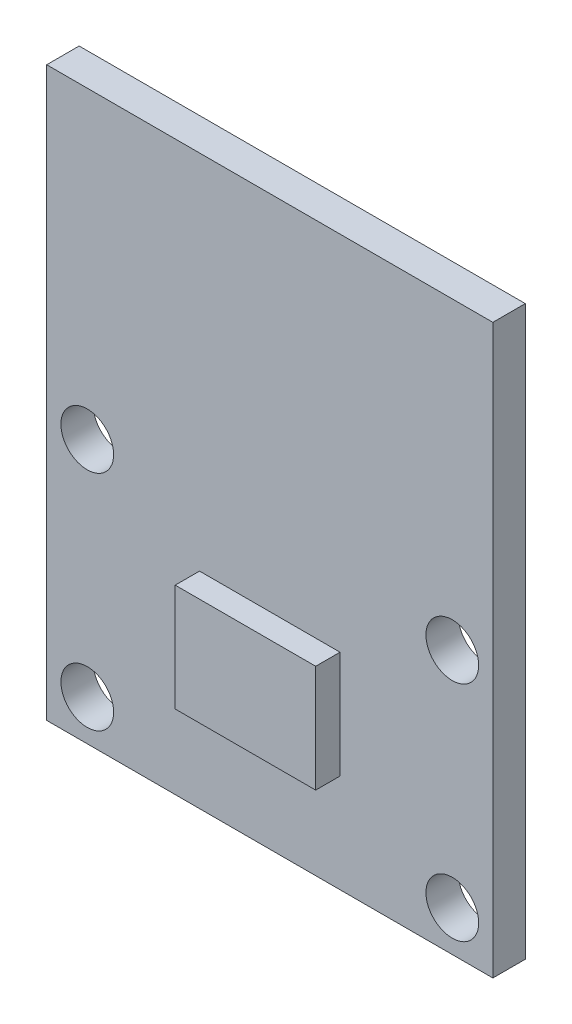
ISO-10303-21;
HEADER;
FILE_DESCRIPTION(('STEP AP214'),'2;1');
FILE_NAME('part.step','',(''),(''),'','','');
FILE_SCHEMA(('AUTOMOTIVE_DESIGN { 1 0 10303 214 1 1 1 1 }'));
ENDSEC;
DATA;
#1=APPLICATION_CONTEXT('core data for automotive mechanical design processes');
#2=APPLICATION_PROTOCOL_DEFINITION('international standard','automotive_design',2000,#1);
#3=PRODUCT_CONTEXT('',#1,'mechanical');
#4=PRODUCT('Part','Part','',(#3));
#5=PRODUCT_RELATED_PRODUCT_CATEGORY('part','',(#4));
#6=PRODUCT_DEFINITION_FORMATION('','',#4);
#7=PRODUCT_DEFINITION_CONTEXT('part definition',#1,'design');
#8=PRODUCT_DEFINITION('design','',#6,#7);
#9=PRODUCT_DEFINITION_SHAPE('','',#8);
#10=(LENGTH_UNIT() NAMED_UNIT(*) SI_UNIT(.MILLI.,.METRE.));
#11=(NAMED_UNIT(*) PLANE_ANGLE_UNIT() SI_UNIT($,.RADIAN.));
#12=(NAMED_UNIT(*) SI_UNIT($,.STERADIAN.) SOLID_ANGLE_UNIT());
#13=UNCERTAINTY_MEASURE_WITH_UNIT(LENGTH_MEASURE(1.E-05),#10,'distance_accuracy_value','');
#14=(GEOMETRIC_REPRESENTATION_CONTEXT(3) GLOBAL_UNCERTAINTY_ASSIGNED_CONTEXT((#13)) GLOBAL_UNIT_ASSIGNED_CONTEXT((#10,
#11,#12)) REPRESENTATION_CONTEXT('',''));
#15=CARTESIAN_POINT('',(0.,0.,0.));
#16=DIRECTION('',(0.,0.,1.));
#17=DIRECTION('',(1.,0.,0.));
#18=AXIS2_PLACEMENT_3D('',#15,#16,#17);
#19=CARTESIAN_POINT('',(0.,0.,1.6));
#20=DIRECTION('',(0.,0.,1.));
#21=DIRECTION('',(1.,0.,0.));
#22=AXIS2_PLACEMENT_3D('',#19,#20,#21);
#23=PLANE('',#22);
#24=CARTESIAN_POINT('',(-9.,-1.,1.6));
#25=DIRECTION('',(0.,0.,1.));
#26=DIRECTION('',(1.,0.,0.));
#27=AXIS2_PLACEMENT_3D('',#24,#25,#26);
#28=CIRCLE('',#27,1.3);
#29=CARTESIAN_POINT('',(-7.7,-1.,1.6));
#30=VERTEX_POINT('',#29);
#31=EDGE_CURVE('E144',#30,#30,#28,.T.);
#32=ORIENTED_EDGE('',*,*,#31,.F.);
#33=EDGE_LOOP('',(#32));
#34=FACE_BOUND('',#33,.T.);
#35=CARTESIAN_POINT('',(-9.,-12.,1.6));
#36=DIRECTION('',(0.,0.,1.));
#37=DIRECTION('',(1.,0.,0.));
#38=AXIS2_PLACEMENT_3D('',#35,#36,#37);
#39=CIRCLE('',#38,1.3);
#40=CARTESIAN_POINT('',(-7.7,-12.,1.6));
#41=VERTEX_POINT('',#40);
#42=EDGE_CURVE('E156',#41,#41,#39,.T.);
#43=ORIENTED_EDGE('',*,*,#42,.F.);
#44=EDGE_LOOP('',(#43));
#45=FACE_BOUND('',#44,.T.);
#46=DIRECTION('',(0.,1.,0.));
#47=VECTOR('',#46,1.);
#48=CARTESIAN_POINT('',(11.,14.,1.6));
#49=LINE('',#48,#47);
#50=CARTESIAN_POINT('',(11.,-14.,1.6));
#51=VERTEX_POINT('',#50);
#52=CARTESIAN_POINT('',(11.,14.,1.6));
#53=VERTEX_POINT('',#52);
#54=EDGE_CURVE('E162',#51,#53,#49,.T.);
#55=ORIENTED_EDGE('',*,*,#54,.T.);
#56=DIRECTION('',(-1.,0.,0.));
#57=VECTOR('',#56,1.);
#58=CARTESIAN_POINT('',(-11.,14.,1.6));
#59=LINE('',#58,#57);
#60=CARTESIAN_POINT('',(-11.,14.,1.6));
#61=VERTEX_POINT('',#60);
#62=EDGE_CURVE('E86',#53,#61,#59,.T.);
#63=ORIENTED_EDGE('',*,*,#62,.T.);
#64=DIRECTION('',(0.,-1.,0.));
#65=VECTOR('',#64,1.);
#66=CARTESIAN_POINT('',(-11.,14.,1.6));
#67=LINE('',#66,#65);
#68=CARTESIAN_POINT('',(-11.,-14.,1.6));
#69=VERTEX_POINT('',#68);
#70=EDGE_CURVE('E165',#61,#69,#67,.T.);
#71=ORIENTED_EDGE('',*,*,#70,.T.);
#72=DIRECTION('',(1.,0.,0.));
#73=VECTOR('',#72,1.);
#74=CARTESIAN_POINT('',(-11.,-14.,1.6));
#75=LINE('',#74,#73);
#76=EDGE_CURVE('E58',#69,#51,#75,.T.);
#77=ORIENTED_EDGE('',*,*,#76,.T.);
#78=EDGE_LOOP('',(#55,#63,#71,#77));
#79=FACE_BOUND('',#78,.T.);
#80=CARTESIAN_POINT('',(9.,-12.,1.6));
#81=DIRECTION('',(0.,0.,1.));
#82=DIRECTION('',(1.,0.,0.));
#83=AXIS2_PLACEMENT_3D('',#80,#81,#82);
#84=CIRCLE('',#83,1.3);
#85=CARTESIAN_POINT('',(10.3,-12.,1.6));
#86=VERTEX_POINT('',#85);
#87=EDGE_CURVE('E150',#86,#86,#84,.T.);
#88=ORIENTED_EDGE('',*,*,#87,.F.);
#89=EDGE_LOOP('',(#88));
#90=FACE_BOUND('',#89,.T.);
#91=CARTESIAN_POINT('',(9.,-1.,1.6));
#92=DIRECTION('',(0.,0.,1.));
#93=DIRECTION('',(1.,0.,0.));
#94=AXIS2_PLACEMENT_3D('',#91,#92,#93);
#95=CIRCLE('',#94,1.3);
#96=CARTESIAN_POINT('',(10.3,-1.,1.6));
#97=VERTEX_POINT('',#96);
#98=EDGE_CURVE('E136',#97,#97,#95,.T.);
#99=ORIENTED_EDGE('',*,*,#98,.F.);
#100=EDGE_LOOP('',(#99));
#101=FACE_BOUND('',#100,.T.);
#102=DIRECTION('',(-1.,0.,0.));
#103=VECTOR('',#102,1.);
#104=CARTESIAN_POINT('',(-3.46343343206932,-3.85520353665282,1.6));
#105=LINE('',#104,#103);
#106=CARTESIAN_POINT('',(3.46343343206932,-3.85520353665282,1.6));
#107=VERTEX_POINT('',#106);
#108=CARTESIAN_POINT('',(-3.46343343206932,-3.85520353665282,1.6));
#109=VERTEX_POINT('',#108);
#110=EDGE_CURVE('E332',#107,#109,#105,.T.);
#111=ORIENTED_EDGE('',*,*,#110,.F.);
#112=DIRECTION('',(0.,1.,0.));
#113=VECTOR('',#112,1.);
#114=CARTESIAN_POINT('',(3.46343343206932,-3.85520353665282,1.6));
#115=LINE('',#114,#113);
#116=CARTESIAN_POINT('',(3.46343343206932,-9.14479646334718,1.6));
#117=VERTEX_POINT('',#116);
#118=EDGE_CURVE('E131',#117,#107,#115,.T.);
#119=ORIENTED_EDGE('',*,*,#118,.F.);
#120=DIRECTION('',(1.,0.,0.));
#121=VECTOR('',#120,1.);
#122=CARTESIAN_POINT('',(-3.46343343206932,-9.14479646334718,1.6));
#123=LINE('',#122,#121);
#124=CARTESIAN_POINT('',(-3.46343343206932,-9.14479646334718,1.6));
#125=VERTEX_POINT('',#124);
#126=EDGE_CURVE('E127',#125,#117,#123,.T.);
#127=ORIENTED_EDGE('',*,*,#126,.F.);
#128=DIRECTION('',(0.,-1.,0.));
#129=VECTOR('',#128,1.);
#130=CARTESIAN_POINT('',(-3.46343343206932,-3.85520353665282,1.6));
#131=LINE('',#130,#129);
#132=EDGE_CURVE('E329',#109,#125,#131,.T.);
#133=ORIENTED_EDGE('',*,*,#132,.F.);
#134=EDGE_LOOP('',(#111,#119,#127,#133));
#135=FACE_BOUND('',#134,.T.);
#136=ADVANCED_FACE('F34',(#34,#45,#79,#90,#101,#135),#23,.T.);
#137=CARTESIAN_POINT('',(0.,0.,0.));
#138=DIRECTION('',(0.,0.,1.));
#139=DIRECTION('',(1.,0.,0.));
#140=AXIS2_PLACEMENT_3D('',#137,#138,#139);
#141=PLANE('',#140);
#142=DIRECTION('',(0.,1.,0.));
#143=VECTOR('',#142,1.);
#144=CARTESIAN_POINT('',(11.,14.,0.));
#145=LINE('',#144,#143);
#146=CARTESIAN_POINT('',(11.,-14.,0.));
#147=VERTEX_POINT('',#146);
#148=CARTESIAN_POINT('',(11.,14.,0.));
#149=VERTEX_POINT('',#148);
#150=EDGE_CURVE('E159',#147,#149,#145,.T.);
#151=ORIENTED_EDGE('',*,*,#150,.F.);
#152=DIRECTION('',(1.,0.,0.));
#153=VECTOR('',#152,1.);
#154=CARTESIAN_POINT('',(-11.,-14.,0.));
#155=LINE('',#154,#153);
#156=CARTESIAN_POINT('',(-11.,-14.,0.));
#157=VERTEX_POINT('',#156);
#158=EDGE_CURVE('E79',#157,#147,#155,.T.);
#159=ORIENTED_EDGE('',*,*,#158,.F.);
#160=DIRECTION('',(0.,-1.,0.));
#161=VECTOR('',#160,1.);
#162=CARTESIAN_POINT('',(-11.,14.,0.));
#163=LINE('',#162,#161);
#164=CARTESIAN_POINT('',(-11.,14.,0.));
#165=VERTEX_POINT('',#164);
#166=EDGE_CURVE('E173',#165,#157,#163,.T.);
#167=ORIENTED_EDGE('',*,*,#166,.F.);
#168=DIRECTION('',(-1.,0.,0.));
#169=VECTOR('',#168,1.);
#170=CARTESIAN_POINT('',(-11.,14.,0.));
#171=LINE('',#170,#169);
#172=EDGE_CURVE('E171',#149,#165,#171,.T.);
#173=ORIENTED_EDGE('',*,*,#172,.F.);
#174=EDGE_LOOP('',(#151,#159,#167,#173));
#175=FACE_BOUND('',#174,.T.);
#176=CARTESIAN_POINT('',(-9.,-12.,0.));
#177=DIRECTION('',(0.,0.,1.));
#178=DIRECTION('',(1.,0.,0.));
#179=AXIS2_PLACEMENT_3D('',#176,#177,#178);
#180=CIRCLE('',#179,1.3);
#181=CARTESIAN_POINT('',(-7.7,-12.,0.));
#182=VERTEX_POINT('',#181);
#183=EDGE_CURVE('E153',#182,#182,#180,.T.);
#184=ORIENTED_EDGE('',*,*,#183,.T.);
#185=EDGE_LOOP('',(#184));
#186=FACE_BOUND('',#185,.T.);
#187=CARTESIAN_POINT('',(9.,-12.,0.));
#188=DIRECTION('',(0.,0.,1.));
#189=DIRECTION('',(1.,0.,0.));
#190=AXIS2_PLACEMENT_3D('',#187,#188,#189);
#191=CIRCLE('',#190,1.3);
#192=CARTESIAN_POINT('',(10.3,-12.,0.));
#193=VERTEX_POINT('',#192);
#194=EDGE_CURVE('E147',#193,#193,#191,.T.);
#195=ORIENTED_EDGE('',*,*,#194,.T.);
#196=EDGE_LOOP('',(#195));
#197=FACE_BOUND('',#196,.T.);
#198=CARTESIAN_POINT('',(-9.,-1.,0.));
#199=DIRECTION('',(0.,0.,1.));
#200=DIRECTION('',(1.,0.,0.));
#201=AXIS2_PLACEMENT_3D('',#198,#199,#200);
#202=CIRCLE('',#201,1.3);
#203=CARTESIAN_POINT('',(-7.7,-1.,0.));
#204=VERTEX_POINT('',#203);
#205=EDGE_CURVE('E142',#204,#204,#202,.T.);
#206=ORIENTED_EDGE('',*,*,#205,.T.);
#207=EDGE_LOOP('',(#206));
#208=FACE_BOUND('',#207,.T.);
#209=CARTESIAN_POINT('',(9.,-1.,0.));
#210=DIRECTION('',(0.,0.,1.));
#211=DIRECTION('',(1.,0.,0.));
#212=AXIS2_PLACEMENT_3D('',#209,#210,#211);
#213=CIRCLE('',#212,1.3);
#214=CARTESIAN_POINT('',(10.3,-1.,0.));
#215=VERTEX_POINT('',#214);
#216=EDGE_CURVE('E133',#215,#215,#213,.T.);
#217=ORIENTED_EDGE('',*,*,#216,.T.);
#218=EDGE_LOOP('',(#217));
#219=FACE_BOUND('',#218,.T.);
#220=ADVANCED_FACE('F186',(#175,#186,#197,#208,#219),#141,.F.);
#221=CARTESIAN_POINT('',(11.,14.,1.6));
#222=DIRECTION('',(-1.,0.,0.));
#223=DIRECTION('',(0.,-1.,0.));
#224=AXIS2_PLACEMENT_3D('',#221,#222,#223);
#225=PLANE('',#224);
#226=ORIENTED_EDGE('',*,*,#150,.T.);
#227=DIRECTION('',(0.,0.,-1.));
#228=VECTOR('',#227,1.);
#229=CARTESIAN_POINT('',(11.,14.,1.6));
#230=LINE('',#229,#228);
#231=EDGE_CURVE('E11',#53,#149,#230,.T.);
#232=ORIENTED_EDGE('',*,*,#231,.F.);
#233=ORIENTED_EDGE('',*,*,#54,.F.);
#234=DIRECTION('',(0.,0.,-1.));
#235=VECTOR('',#234,1.);
#236=CARTESIAN_POINT('',(11.,-14.,1.6));
#237=LINE('',#236,#235);
#238=EDGE_CURVE('E168',#51,#147,#237,.T.);
#239=ORIENTED_EDGE('',*,*,#238,.T.);
#240=EDGE_LOOP('',(#226,#232,#233,#239));
#241=FACE_BOUND('',#240,.T.);
#242=ADVANCED_FACE('F36',(#241),#225,.F.);
#243=CARTESIAN_POINT('',(-11.,14.,1.6));
#244=DIRECTION('',(0.,-1.,0.));
#245=DIRECTION('',(0.,0.,-1.));
#246=AXIS2_PLACEMENT_3D('',#243,#244,#245);
#247=PLANE('',#246);
#248=ORIENTED_EDGE('',*,*,#172,.T.);
#249=DIRECTION('',(0.,0.,-1.));
#250=VECTOR('',#249,1.);
#251=CARTESIAN_POINT('',(-11.,14.,1.6));
#252=LINE('',#251,#250);
#253=EDGE_CURVE('E42',#61,#165,#252,.T.);
#254=ORIENTED_EDGE('',*,*,#253,.F.);
#255=ORIENTED_EDGE('',*,*,#62,.F.);
#256=ORIENTED_EDGE('',*,*,#231,.T.);
#257=EDGE_LOOP('',(#248,#254,#255,#256));
#258=FACE_BOUND('',#257,.T.);
#259=ADVANCED_FACE('F202',(#258),#247,.F.);
#260=CARTESIAN_POINT('',(-11.,14.,1.6));
#261=DIRECTION('',(1.,0.,0.));
#262=DIRECTION('',(0.,1.,0.));
#263=AXIS2_PLACEMENT_3D('',#260,#261,#262);
#264=PLANE('',#263);
#265=ORIENTED_EDGE('',*,*,#166,.T.);
#266=DIRECTION('',(0.,0.,-1.));
#267=VECTOR('',#266,1.);
#268=CARTESIAN_POINT('',(-11.,-14.,1.6));
#269=LINE('',#268,#267);
#270=EDGE_CURVE('E177',#69,#157,#269,.T.);
#271=ORIENTED_EDGE('',*,*,#270,.F.);
#272=ORIENTED_EDGE('',*,*,#70,.F.);
#273=ORIENTED_EDGE('',*,*,#253,.T.);
#274=EDGE_LOOP('',(#265,#271,#272,#273));
#275=FACE_BOUND('',#274,.T.);
#276=ADVANCED_FACE('F182',(#275),#264,.F.);
#277=CARTESIAN_POINT('',(-11.,-14.,1.6));
#278=DIRECTION('',(0.,1.,0.));
#279=DIRECTION('',(0.,0.,1.));
#280=AXIS2_PLACEMENT_3D('',#277,#278,#279);
#281=PLANE('',#280);
#282=ORIENTED_EDGE('',*,*,#158,.T.);
#283=ORIENTED_EDGE('',*,*,#238,.F.);
#284=ORIENTED_EDGE('',*,*,#76,.F.);
#285=ORIENTED_EDGE('',*,*,#270,.T.);
#286=EDGE_LOOP('',(#282,#283,#284,#285));
#287=FACE_BOUND('',#286,.T.);
#288=ADVANCED_FACE('F191',(#287),#281,.F.);
#289=CARTESIAN_POINT('',(-9.,-12.,1.6));
#290=DIRECTION('',(0.,0.,-1.));
#291=DIRECTION('',(-1.,0.,0.));
#292=AXIS2_PLACEMENT_3D('',#289,#290,#291);
#293=CYLINDRICAL_SURFACE('',#292,1.3);
#294=ORIENTED_EDGE('',*,*,#42,.T.);
#295=EDGE_LOOP('',(#294));
#296=FACE_BOUND('',#295,.T.);
#297=ORIENTED_EDGE('',*,*,#183,.F.);
#298=EDGE_LOOP('',(#297));
#299=FACE_BOUND('',#298,.T.);
#300=ADVANCED_FACE('F193',(#296,#299),#293,.F.);
#301=CARTESIAN_POINT('',(9.,-12.,1.6));
#302=DIRECTION('',(0.,0.,-1.));
#303=DIRECTION('',(-1.,0.,0.));
#304=AXIS2_PLACEMENT_3D('',#301,#302,#303);
#305=CYLINDRICAL_SURFACE('',#304,1.3);
#306=ORIENTED_EDGE('',*,*,#87,.T.);
#307=EDGE_LOOP('',(#306));
#308=FACE_BOUND('',#307,.T.);
#309=ORIENTED_EDGE('',*,*,#194,.F.);
#310=EDGE_LOOP('',(#309));
#311=FACE_BOUND('',#310,.T.);
#312=ADVANCED_FACE('F199',(#308,#311),#305,.F.);
#313=CARTESIAN_POINT('',(-9.,-1.,1.6));
#314=DIRECTION('',(0.,0.,-1.));
#315=DIRECTION('',(-1.,0.,0.));
#316=AXIS2_PLACEMENT_3D('',#313,#314,#315);
#317=CYLINDRICAL_SURFACE('',#316,1.3);
#318=ORIENTED_EDGE('',*,*,#31,.T.);
#319=EDGE_LOOP('',(#318));
#320=FACE_BOUND('',#319,.T.);
#321=ORIENTED_EDGE('',*,*,#205,.F.);
#322=EDGE_LOOP('',(#321));
#323=FACE_BOUND('',#322,.T.);
#324=ADVANCED_FACE('F216',(#320,#323),#317,.F.);
#325=CARTESIAN_POINT('',(9.,-1.,1.6));
#326=DIRECTION('',(0.,0.,-1.));
#327=DIRECTION('',(-1.,0.,0.));
#328=AXIS2_PLACEMENT_3D('',#325,#326,#327);
#329=CYLINDRICAL_SURFACE('',#328,1.3);
#330=ORIENTED_EDGE('',*,*,#98,.T.);
#331=EDGE_LOOP('',(#330));
#332=FACE_BOUND('',#331,.T.);
#333=ORIENTED_EDGE('',*,*,#216,.F.);
#334=EDGE_LOOP('',(#333));
#335=FACE_BOUND('',#334,.T.);
#336=ADVANCED_FACE('F220',(#332,#335),#329,.F.);
#337=CARTESIAN_POINT('',(3.46343343206932,-3.85520353665282,2.8));
#338=DIRECTION('',(-1.,0.,0.));
#339=DIRECTION('',(0.,0.,1.));
#340=AXIS2_PLACEMENT_3D('',#337,#338,#339);
#341=PLANE('',#340);
#342=ORIENTED_EDGE('',*,*,#118,.T.);
#343=DIRECTION('',(0.,0.,-1.));
#344=VECTOR('',#343,1.);
#345=CARTESIAN_POINT('',(3.46343343206932,-3.85520353665282,2.8));
#346=LINE('',#345,#344);
#347=CARTESIAN_POINT('',(3.46343343206932,-3.85520353665282,2.8));
#348=VERTEX_POINT('',#347);
#349=EDGE_CURVE('E112',#348,#107,#346,.T.);
#350=ORIENTED_EDGE('',*,*,#349,.F.);
#351=DIRECTION('',(0.,1.,0.));
#352=VECTOR('',#351,1.);
#353=CARTESIAN_POINT('',(3.46343343206932,-3.85520353665282,2.8));
#354=LINE('',#353,#352);
#355=CARTESIAN_POINT('',(3.46343343206932,-9.14479646334718,2.8));
#356=VERTEX_POINT('',#355);
#357=EDGE_CURVE('E119',#356,#348,#354,.T.);
#358=ORIENTED_EDGE('',*,*,#357,.F.);
#359=DIRECTION('',(0.,0.,-1.));
#360=VECTOR('',#359,1.);
#361=CARTESIAN_POINT('',(3.46343343206932,-9.14479646334718,2.8));
#362=LINE('',#361,#360);
#363=EDGE_CURVE('E326',#356,#117,#362,.T.);
#364=ORIENTED_EDGE('',*,*,#363,.T.);
#365=EDGE_LOOP('',(#342,#350,#358,#364));
#366=FACE_BOUND('',#365,.T.);
#367=ADVANCED_FACE('F129',(#366),#341,.F.);
#368=CARTESIAN_POINT('',(-3.46343343206932,-3.85520353665282,2.8));
#369=DIRECTION('',(0.,-1.,0.));
#370=DIRECTION('',(0.,0.,-1.));
#371=AXIS2_PLACEMENT_3D('',#368,#369,#370);
#372=PLANE('',#371);
#373=ORIENTED_EDGE('',*,*,#110,.T.);
#374=DIRECTION('',(0.,0.,-1.));
#375=VECTOR('',#374,1.);
#376=CARTESIAN_POINT('',(-3.46343343206932,-3.85520353665282,2.8));
#377=LINE('',#376,#375);
#378=CARTESIAN_POINT('',(-3.46343343206932,-3.85520353665282,2.8));
#379=VERTEX_POINT('',#378);
#380=EDGE_CURVE('E115',#379,#109,#377,.T.);
#381=ORIENTED_EDGE('',*,*,#380,.F.);
#382=DIRECTION('',(-1.,0.,0.));
#383=VECTOR('',#382,1.);
#384=CARTESIAN_POINT('',(-3.46343343206932,-3.85520353665282,2.8));
#385=LINE('',#384,#383);
#386=EDGE_CURVE('E108',#348,#379,#385,.T.);
#387=ORIENTED_EDGE('',*,*,#386,.F.);
#388=ORIENTED_EDGE('',*,*,#349,.T.);
#389=EDGE_LOOP('',(#373,#381,#387,#388));
#390=FACE_BOUND('',#389,.T.);
#391=ADVANCED_FACE('F110',(#390),#372,.F.);
#392=CARTESIAN_POINT('',(-3.46343343206932,-3.85520353665282,2.8));
#393=DIRECTION('',(1.,0.,0.));
#394=DIRECTION('',(0.,0.,-1.));
#395=AXIS2_PLACEMENT_3D('',#392,#393,#394);
#396=PLANE('',#395);
#397=ORIENTED_EDGE('',*,*,#132,.T.);
#398=DIRECTION('',(0.,0.,-1.));
#399=VECTOR('',#398,1.);
#400=CARTESIAN_POINT('',(-3.46343343206932,-9.14479646334718,2.8));
#401=LINE('',#400,#399);
#402=CARTESIAN_POINT('',(-3.46343343206932,-9.14479646334718,2.8));
#403=VERTEX_POINT('',#402);
#404=EDGE_CURVE('E49',#403,#125,#401,.T.);
#405=ORIENTED_EDGE('',*,*,#404,.F.);
#406=DIRECTION('',(0.,-1.,0.));
#407=VECTOR('',#406,1.);
#408=CARTESIAN_POINT('',(-3.46343343206932,-3.85520353665282,2.8));
#409=LINE('',#408,#407);
#410=EDGE_CURVE('E118',#379,#403,#409,.T.);
#411=ORIENTED_EDGE('',*,*,#410,.F.);
#412=ORIENTED_EDGE('',*,*,#380,.T.);
#413=EDGE_LOOP('',(#397,#405,#411,#412));
#414=FACE_BOUND('',#413,.T.);
#415=ADVANCED_FACE('F229',(#414),#396,.F.);
#416=CARTESIAN_POINT('',(-3.46343343206932,-9.14479646334718,2.8));
#417=DIRECTION('',(0.,1.,0.));
#418=DIRECTION('',(0.,0.,1.));
#419=AXIS2_PLACEMENT_3D('',#416,#417,#418);
#420=PLANE('',#419);
#421=ORIENTED_EDGE('',*,*,#126,.T.);
#422=ORIENTED_EDGE('',*,*,#363,.F.);
#423=DIRECTION('',(1.,0.,0.));
#424=VECTOR('',#423,1.);
#425=CARTESIAN_POINT('',(-3.46343343206932,-9.14479646334718,2.8));
#426=LINE('',#425,#424);
#427=EDGE_CURVE('E123',#403,#356,#426,.T.);
#428=ORIENTED_EDGE('',*,*,#427,.F.);
#429=ORIENTED_EDGE('',*,*,#404,.T.);
#430=EDGE_LOOP('',(#421,#422,#428,#429));
#431=FACE_BOUND('',#430,.T.);
#432=ADVANCED_FACE('F232',(#431),#420,.F.);
#433=CARTESIAN_POINT('',(0.,0.,2.8));
#434=DIRECTION('',(0.,0.,1.));
#435=DIRECTION('',(1.,0.,0.));
#436=AXIS2_PLACEMENT_3D('',#433,#434,#435);
#437=PLANE('',#436);
#438=ORIENTED_EDGE('',*,*,#357,.T.);
#439=ORIENTED_EDGE('',*,*,#386,.T.);
#440=ORIENTED_EDGE('',*,*,#410,.T.);
#441=ORIENTED_EDGE('',*,*,#427,.T.);
#442=EDGE_LOOP('',(#438,#439,#440,#441));
#443=FACE_BOUND('',#442,.T.);
#444=ADVANCED_FACE('F122',(#443),#437,.T.);
#445=CLOSED_SHELL('',(#136,#220,#242,#259,#276,#288,#300,#312,#324,#336,#367,#391,#415,#432,#444));
#446=MANIFOLD_SOLID_BREP('B2',#445);
#447=ADVANCED_BREP_SHAPE_REPRESENTATION('',(#18,#446),#14);
#448=SHAPE_DEFINITION_REPRESENTATION(#9,#447);
ENDSEC;
END-ISO-10303-21;
